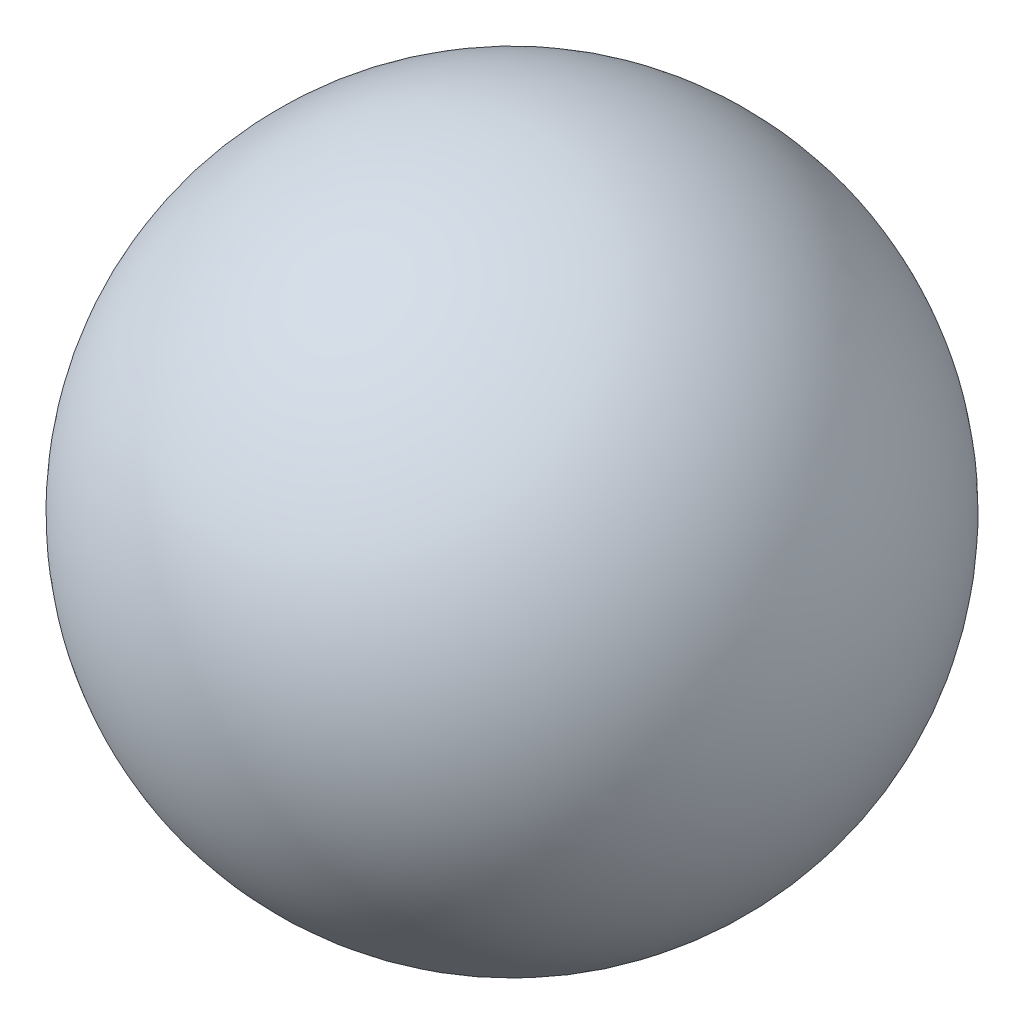
ISO-10303-21;
HEADER;
FILE_DESCRIPTION(('STEP AP214'),'2;1');
FILE_NAME('part.step','',(''),(''),'','','');
FILE_SCHEMA(('AUTOMOTIVE_DESIGN { 1 0 10303 214 1 1 1 1 }'));
ENDSEC;
DATA;
#1=APPLICATION_CONTEXT('core data for automotive mechanical design processes');
#2=APPLICATION_PROTOCOL_DEFINITION('international standard','automotive_design',2000,#1);
#3=PRODUCT_CONTEXT('',#1,'mechanical');
#4=PRODUCT('Part','Part','',(#3));
#5=PRODUCT_RELATED_PRODUCT_CATEGORY('part','',(#4));
#6=PRODUCT_DEFINITION_FORMATION('','',#4);
#7=PRODUCT_DEFINITION_CONTEXT('part definition',#1,'design');
#8=PRODUCT_DEFINITION('design','',#6,#7);
#9=PRODUCT_DEFINITION_SHAPE('','',#8);
#10=(LENGTH_UNIT() NAMED_UNIT(*) SI_UNIT(.MILLI.,.METRE.));
#11=(NAMED_UNIT(*) PLANE_ANGLE_UNIT() SI_UNIT($,.RADIAN.));
#12=(NAMED_UNIT(*) SI_UNIT($,.STERADIAN.) SOLID_ANGLE_UNIT());
#13=UNCERTAINTY_MEASURE_WITH_UNIT(LENGTH_MEASURE(1.E-05),#10,'distance_accuracy_value','');
#14=(GEOMETRIC_REPRESENTATION_CONTEXT(3) GLOBAL_UNCERTAINTY_ASSIGNED_CONTEXT((#13)) GLOBAL_UNIT_ASSIGNED_CONTEXT((#10,
#11,#12)) REPRESENTATION_CONTEXT('',''));
#15=CARTESIAN_POINT('',(0.,0.,0.));
#16=DIRECTION('',(0.,0.,1.));
#17=DIRECTION('',(1.,0.,0.));
#18=AXIS2_PLACEMENT_3D('',#15,#16,#17);
#19=CARTESIAN_POINT('',(7.91857153504746,-3.,-1.1385187061863));
#20=DIRECTION('',(0.,0.,1.));
#21=DIRECTION('',(1.,0.,0.));
#22=AXIS2_PLACEMENT_3D('',#19,#20,#21);
#23=SPHERICAL_SURFACE('',#22,1.8);
#24=CARTESIAN_POINT('',(7.91857153504746,-3.,0.6614812938137));
#25=VERTEX_POINT('',#24);
#26=VERTEX_LOOP('',#25);
#27=FACE_BOUND('',#26,.T.);
#28=ADVANCED_FACE('F12',(#27),#23,.T.);
#29=CLOSED_SHELL('',(#28));
#30=MANIFOLD_SOLID_BREP('B1',#29);
#31=ADVANCED_BREP_SHAPE_REPRESENTATION('',(#18,#30),#14);
#32=SHAPE_DEFINITION_REPRESENTATION(#9,#31);
ENDSEC;
END-ISO-10303-21;
